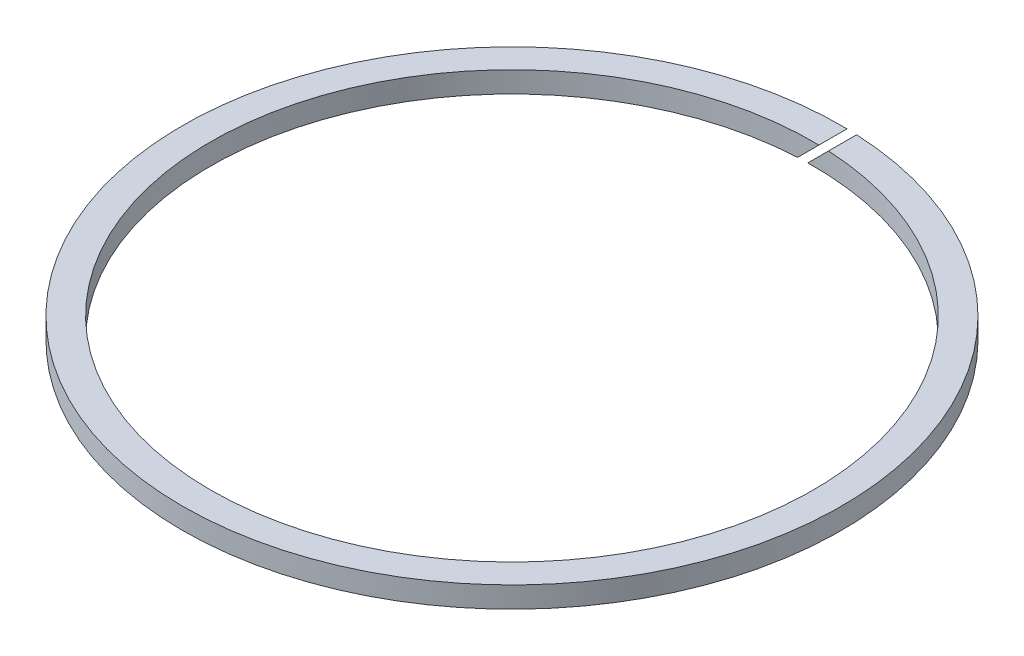
ISO-10303-21;
HEADER;
FILE_DESCRIPTION(('STEP AP214'),'2;1');
FILE_NAME('part.step','',(''),(''),'','','');
FILE_SCHEMA(('AUTOMOTIVE_DESIGN { 1 0 10303 214 1 1 1 1 }'));
ENDSEC;
DATA;
#1=APPLICATION_CONTEXT('core data for automotive mechanical design processes');
#2=APPLICATION_PROTOCOL_DEFINITION('international standard','automotive_design',2000,#1);
#3=PRODUCT_CONTEXT('',#1,'mechanical');
#4=PRODUCT('Part','Part','',(#3));
#5=PRODUCT_RELATED_PRODUCT_CATEGORY('part','',(#4));
#6=PRODUCT_DEFINITION_FORMATION('','',#4);
#7=PRODUCT_DEFINITION_CONTEXT('part definition',#1,'design');
#8=PRODUCT_DEFINITION('design','',#6,#7);
#9=PRODUCT_DEFINITION_SHAPE('','',#8);
#10=(LENGTH_UNIT() NAMED_UNIT(*) SI_UNIT(.MILLI.,.METRE.));
#11=(NAMED_UNIT(*) PLANE_ANGLE_UNIT() SI_UNIT($,.RADIAN.));
#12=(NAMED_UNIT(*) SI_UNIT($,.STERADIAN.) SOLID_ANGLE_UNIT());
#13=UNCERTAINTY_MEASURE_WITH_UNIT(LENGTH_MEASURE(1.E-05),#10,'distance_accuracy_value','');
#14=(GEOMETRIC_REPRESENTATION_CONTEXT(3) GLOBAL_UNCERTAINTY_ASSIGNED_CONTEXT((#13)) GLOBAL_UNIT_ASSIGNED_CONTEXT((#10,
#11,#12)) REPRESENTATION_CONTEXT('',''));
#15=CARTESIAN_POINT('',(0.,0.,0.));
#16=DIRECTION('',(0.,0.,1.));
#17=DIRECTION('',(1.,0.,0.));
#18=AXIS2_PLACEMENT_3D('',#15,#16,#17);
#19=CARTESIAN_POINT('',(0.,1.5,0.));
#20=DIRECTION('',(0.,1.,0.));
#21=DIRECTION('',(0.,0.,1.));
#22=AXIS2_PLACEMENT_3D('',#19,#20,#21);
#23=PLANE('',#22);
#24=DIRECTION('',(0.,0.,1.));
#25=VECTOR('',#24,1.);
#26=CARTESIAN_POINT('',(0.792893218800828,1.49999999998226,-47.));
#27=LINE('',#26,#25);
#28=CARTESIAN_POINT('',(0.792893218800828,1.49999999998226,-46.9933114426253));
#29=VERTEX_POINT('',#28);
#30=CARTESIAN_POINT('',(0.792893218800828,1.5,-42.9926891499425));
#31=VERTEX_POINT('',#30);
#32=EDGE_CURVE('E55',#29,#31,#27,.T.);
#33=ORIENTED_EDGE('',*,*,#32,.F.);
#34=CARTESIAN_POINT('',(0.,1.5,0.));
#35=DIRECTION('',(0.,1.,0.));
#36=DIRECTION('',(0.,0.,1.));
#37=AXIS2_PLACEMENT_3D('',#34,#35,#36);
#38=CIRCLE('',#37,47.);
#39=CARTESIAN_POINT('',(2.2071067812135,1.50000000001069,-46.9481488416351));
#40=VERTEX_POINT('',#39);
#41=EDGE_CURVE('E92',#29,#40,#38,.T.);
#42=ORIENTED_EDGE('',*,*,#41,.T.);
#43=DIRECTION('',(0.,0.,1.));
#44=VECTOR('',#43,1.);
#45=CARTESIAN_POINT('',(2.2071067812135,1.50000000001069,-47.));
#46=LINE('',#45,#44);
#47=CARTESIAN_POINT('',(2.2071067812135,1.50000000001069,-42.9433193833025));
#48=VERTEX_POINT('',#47);
#49=EDGE_CURVE('E74',#40,#48,#46,.T.);
#50=ORIENTED_EDGE('',*,*,#49,.T.);
#51=CARTESIAN_POINT('',(0.,1.5,0.));
#52=DIRECTION('',(0.,1.,0.));
#53=DIRECTION('',(0.,0.,1.));
#54=AXIS2_PLACEMENT_3D('',#51,#52,#53);
#55=CIRCLE('',#54,43.);
#56=EDGE_CURVE('E93',#31,#48,#55,.T.);
#57=ORIENTED_EDGE('',*,*,#56,.F.);
#58=EDGE_LOOP('',(#33,#42,#50,#57));
#59=FACE_BOUND('',#58,.T.);
#60=ADVANCED_FACE('F33',(#59),#23,.T.);
#61=CARTESIAN_POINT('',(0.,-1.5,0.));
#62=DIRECTION('',(0.,1.,0.));
#63=DIRECTION('',(0.,0.,1.));
#64=AXIS2_PLACEMENT_3D('',#61,#62,#63);
#65=PLANE('',#64);
#66=CARTESIAN_POINT('',(0.,-1.5,0.));
#67=DIRECTION('',(0.,1.,0.));
#68=DIRECTION('',(0.,0.,1.));
#69=AXIS2_PLACEMENT_3D('',#66,#67,#68);
#70=CIRCLE('',#69,47.);
#71=CARTESIAN_POINT('',(-2.20710678125613,-1.5000000000249,-46.9481488416331));
#72=VERTEX_POINT('',#71);
#73=CARTESIAN_POINT('',(-0.792893218871882,-1.5000000000249,-46.9933114426241));
#74=VERTEX_POINT('',#73);
#75=EDGE_CURVE('E87',#72,#74,#70,.T.);
#76=ORIENTED_EDGE('',*,*,#75,.F.);
#77=DIRECTION('',(0.,0.,1.));
#78=VECTOR('',#77,1.);
#79=CARTESIAN_POINT('',(-2.20710678125613,-1.5000000000249,-47.));
#80=LINE('',#79,#78);
#81=CARTESIAN_POINT('',(-2.20710678125613,-1.5000000000249,-42.9433193833003));
#82=VERTEX_POINT('',#81);
#83=EDGE_CURVE('E80',#72,#82,#80,.T.);
#84=ORIENTED_EDGE('',*,*,#83,.T.);
#85=CARTESIAN_POINT('',(0.,-1.5,0.));
#86=DIRECTION('',(0.,1.,0.));
#87=DIRECTION('',(0.,0.,1.));
#88=AXIS2_PLACEMENT_3D('',#85,#86,#87);
#89=CIRCLE('',#88,43.);
#90=CARTESIAN_POINT('',(-0.792893218846984,-1.5,-42.9926891499416));
#91=VERTEX_POINT('',#90);
#92=EDGE_CURVE('E89',#82,#91,#89,.T.);
#93=ORIENTED_EDGE('',*,*,#92,.T.);
#94=DIRECTION('',(0.,0.,1.));
#95=VECTOR('',#94,1.);
#96=CARTESIAN_POINT('',(-0.792893218871882,-1.5000000000249,-47.));
#97=LINE('',#96,#95);
#98=EDGE_CURVE('E48',#74,#91,#97,.T.);
#99=ORIENTED_EDGE('',*,*,#98,.F.);
#100=EDGE_LOOP('',(#76,#84,#93,#99));
#101=FACE_BOUND('',#100,.T.);
#102=ADVANCED_FACE('F85',(#101),#65,.F.);
#103=CARTESIAN_POINT('',(0.,1.5,0.));
#104=DIRECTION('',(0.,-1.,0.));
#105=DIRECTION('',(0.,0.,-1.));
#106=AXIS2_PLACEMENT_3D('',#103,#104,#105);
#107=CYLINDRICAL_SURFACE('',#106,47.);
#108=ORIENTED_EDGE('',*,*,#41,.F.);
#109=CARTESIAN_POINT('',(0.,0.707106781194598,0.));
#110=DIRECTION('',(-0.707106781180679,0.707106781192416,0.));
#111=DIRECTION('',(-0.707106781192416,-0.707106781180679,0.));
#112=AXIS2_PLACEMENT_3D('',#109,#110,#111);
#113=ELLIPSE('',#112,66.4680374309839,47.);
#114=EDGE_CURVE('E79',#29,#72,#113,.T.);
#115=ORIENTED_EDGE('',*,*,#114,.T.);
#116=ORIENTED_EDGE('',*,*,#75,.T.);
#117=CARTESIAN_POINT('',(0.,-0.707106781166177,0.));
#118=DIRECTION('',(0.707106781180679,-0.707106781192416,0.));
#119=DIRECTION('',(-0.707106781192416,-0.707106781180679,0.));
#120=AXIS2_PLACEMENT_3D('',#117,#118,#119);
#121=ELLIPSE('',#120,66.4680374309839,47.);
#122=EDGE_CURVE('E71',#74,#40,#121,.T.);
#123=ORIENTED_EDGE('',*,*,#122,.T.);
#124=EDGE_LOOP('',(#108,#115,#116,#123));
#125=FACE_BOUND('',#124,.T.);
#126=ADVANCED_FACE('F35',(#125),#107,.T.);
#127=CARTESIAN_POINT('',(0.,1.5,0.));
#128=DIRECTION('',(0.,-1.,0.));
#129=DIRECTION('',(0.,0.,-1.));
#130=AXIS2_PLACEMENT_3D('',#127,#128,#129);
#131=CYLINDRICAL_SURFACE('',#130,43.);
#132=CARTESIAN_POINT('',(0.,0.707106781194598,0.));
#133=DIRECTION('',(-0.707106781180679,0.707106781192416,0.));
#134=DIRECTION('',(-0.707106781192416,-0.707106781180679,0.));
#135=AXIS2_PLACEMENT_3D('',#132,#133,#134);
#136=ELLIPSE('',#135,60.8111831815384,43.);
#137=EDGE_CURVE('E11',#31,#82,#136,.T.);
#138=ORIENTED_EDGE('',*,*,#137,.F.);
#139=ORIENTED_EDGE('',*,*,#56,.T.);
#140=CARTESIAN_POINT('',(0.,-0.707106781166177,0.));
#141=DIRECTION('',(0.707106781180679,-0.707106781192416,0.));
#142=DIRECTION('',(-0.707106781192416,-0.707106781180679,0.));
#143=AXIS2_PLACEMENT_3D('',#140,#141,#142);
#144=ELLIPSE('',#143,60.8111831815384,43.);
#145=EDGE_CURVE('E41',#91,#48,#144,.T.);
#146=ORIENTED_EDGE('',*,*,#145,.F.);
#147=ORIENTED_EDGE('',*,*,#92,.F.);
#148=EDGE_LOOP('',(#138,#139,#146,#147));
#149=FACE_BOUND('',#148,.T.);
#150=ADVANCED_FACE('F103',(#149),#131,.F.);
#151=CARTESIAN_POINT('',(2.2071067812135,1.50000000001069,-47.));
#152=DIRECTION('',(0.707106781180679,-0.707106781192416,0.));
#153=DIRECTION('',(0.707106781192416,0.707106781180679,0.));
#154=AXIS2_PLACEMENT_3D('',#151,#152,#153);
#155=PLANE('',#154);
#156=ORIENTED_EDGE('',*,*,#98,.T.);
#157=ORIENTED_EDGE('',*,*,#145,.T.);
#158=ORIENTED_EDGE('',*,*,#49,.F.);
#159=ORIENTED_EDGE('',*,*,#122,.F.);
#160=EDGE_LOOP('',(#156,#157,#158,#159));
#161=FACE_BOUND('',#160,.T.);
#162=ADVANCED_FACE('F72',(#161),#155,.F.);
#163=CARTESIAN_POINT('',(0.792893218800828,1.49999999998226,-47.));
#164=DIRECTION('',(-0.707106781180679,0.707106781192416,0.));
#165=DIRECTION('',(-0.707106781192416,-0.707106781180679,0.));
#166=AXIS2_PLACEMENT_3D('',#163,#164,#165);
#167=PLANE('',#166);
#168=ORIENTED_EDGE('',*,*,#32,.T.);
#169=ORIENTED_EDGE('',*,*,#137,.T.);
#170=ORIENTED_EDGE('',*,*,#83,.F.);
#171=ORIENTED_EDGE('',*,*,#114,.F.);
#172=EDGE_LOOP('',(#168,#169,#170,#171));
#173=FACE_BOUND('',#172,.T.);
#174=ADVANCED_FACE('F104',(#173),#167,.F.);
#175=CLOSED_SHELL('',(#60,#102,#126,#150,#162,#174));
#176=MANIFOLD_SOLID_BREP('B2',#175);
#177=ADVANCED_BREP_SHAPE_REPRESENTATION('',(#18,#176),#14);
#178=SHAPE_DEFINITION_REPRESENTATION(#9,#177);
ENDSEC;
END-ISO-10303-21;
